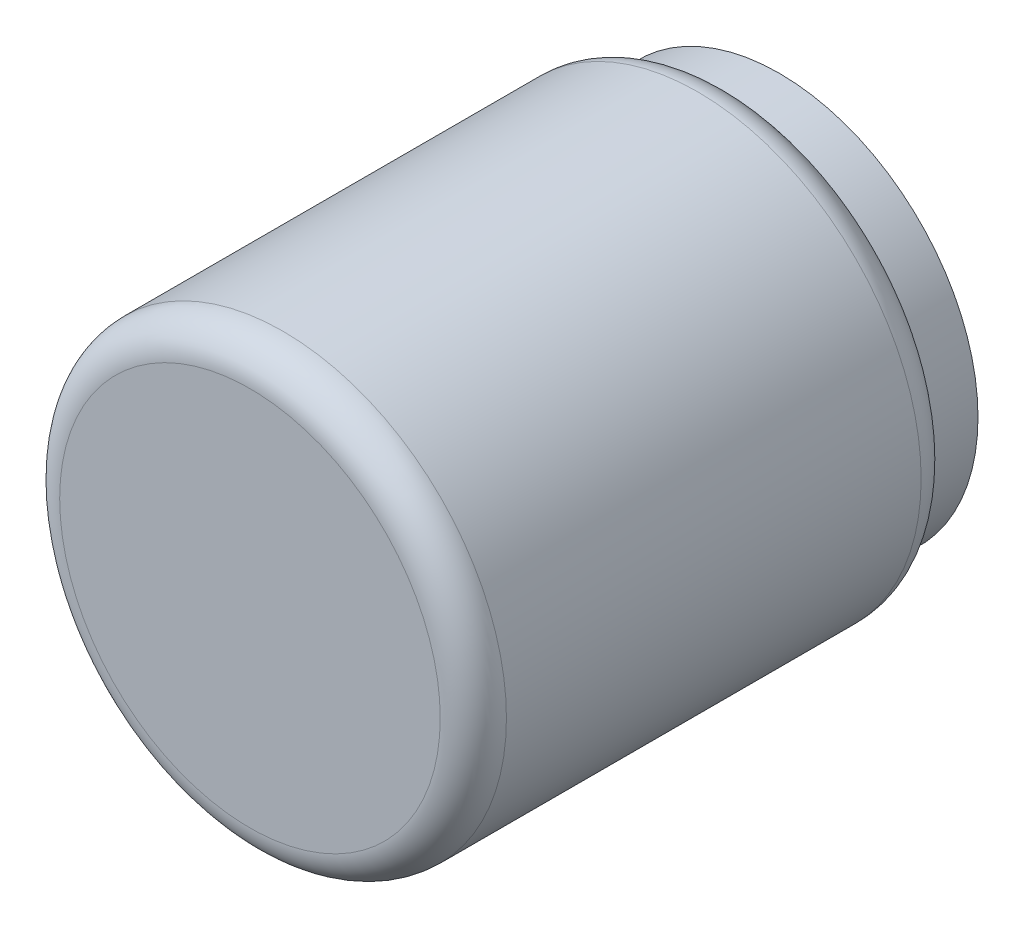
ISO-10303-21;
HEADER;
FILE_DESCRIPTION(('STEP AP214'),'2;1');
FILE_NAME('part.step','',(''),(''),'','','');
FILE_SCHEMA(('AUTOMOTIVE_DESIGN { 1 0 10303 214 1 1 1 1 }'));
ENDSEC;
DATA;
#1=APPLICATION_CONTEXT('core data for automotive mechanical design processes');
#2=APPLICATION_PROTOCOL_DEFINITION('international standard','automotive_design',2000,#1);
#3=PRODUCT_CONTEXT('',#1,'mechanical');
#4=PRODUCT('Part','Part','',(#3));
#5=PRODUCT_RELATED_PRODUCT_CATEGORY('part','',(#4));
#6=PRODUCT_DEFINITION_FORMATION('','',#4);
#7=PRODUCT_DEFINITION_CONTEXT('part definition',#1,'design');
#8=PRODUCT_DEFINITION('design','',#6,#7);
#9=PRODUCT_DEFINITION_SHAPE('','',#8);
#10=(LENGTH_UNIT() NAMED_UNIT(*) SI_UNIT(.MILLI.,.METRE.));
#11=(NAMED_UNIT(*) PLANE_ANGLE_UNIT() SI_UNIT($,.RADIAN.));
#12=(NAMED_UNIT(*) SI_UNIT($,.STERADIAN.) SOLID_ANGLE_UNIT());
#13=UNCERTAINTY_MEASURE_WITH_UNIT(LENGTH_MEASURE(1.E-05),#10,'distance_accuracy_value','');
#14=(GEOMETRIC_REPRESENTATION_CONTEXT(3) GLOBAL_UNCERTAINTY_ASSIGNED_CONTEXT((#13)) GLOBAL_UNIT_ASSIGNED_CONTEXT((#10,
#11,#12)) REPRESENTATION_CONTEXT('',''));
#15=CARTESIAN_POINT('',(0.,0.,0.));
#16=DIRECTION('',(0.,0.,1.));
#17=DIRECTION('',(1.,0.,0.));
#18=AXIS2_PLACEMENT_3D('',#15,#16,#17);
#19=CARTESIAN_POINT('',(0.,0.,32.));
#20=DIRECTION('',(0.,0.,-1.));
#21=DIRECTION('',(-1.,0.,0.));
#22=AXIS2_PLACEMENT_3D('',#19,#20,#21);
#23=CYLINDRICAL_SURFACE('',#22,13.5);
#24=CARTESIAN_POINT('',(0.,0.,4.93649167310371));
#25=DIRECTION('',(0.,0.,-1.));
#26=DIRECTION('',(-1.,0.,0.));
#27=AXIS2_PLACEMENT_3D('',#24,#25,#26);
#28=CIRCLE('',#27,13.5);
#29=CARTESIAN_POINT('',(-13.5,0.,4.93649167310371));
#30=VERTEX_POINT('',#29);
#31=EDGE_CURVE('E10',#30,#30,#28,.F.);
#32=ORIENTED_EDGE('',*,*,#31,.T.);
#33=EDGE_LOOP('',(#32));
#34=FACE_BOUND('',#33,.T.);
#35=CARTESIAN_POINT('',(0.,0.,30.));
#36=DIRECTION('',(0.,0.,1.));
#37=DIRECTION('',(1.,0.,0.));
#38=AXIS2_PLACEMENT_3D('',#35,#36,#37);
#39=CIRCLE('',#38,13.5);
#40=CARTESIAN_POINT('',(13.5,0.,30.));
#41=VERTEX_POINT('',#40);
#42=EDGE_CURVE('E39',#41,#41,#39,.F.);
#43=ORIENTED_EDGE('',*,*,#42,.T.);
#44=EDGE_LOOP('',(#43));
#45=FACE_BOUND('',#44,.T.);
#46=ADVANCED_FACE('F32',(#34,#45),#23,.T.);
#47=CARTESIAN_POINT('',(0.,0.,32.));
#48=DIRECTION('',(0.,0.,1.));
#49=DIRECTION('',(1.,0.,0.));
#50=AXIS2_PLACEMENT_3D('',#47,#48,#49);
#51=PLANE('',#50);
#52=CARTESIAN_POINT('',(0.,0.,32.));
#53=DIRECTION('',(0.,0.,1.));
#54=DIRECTION('',(1.,0.,0.));
#55=AXIS2_PLACEMENT_3D('',#52,#53,#54);
#56=CIRCLE('',#55,11.5);
#57=CARTESIAN_POINT('',(11.5,0.,32.));
#58=VERTEX_POINT('',#57);
#59=EDGE_CURVE('E43',#58,#58,#56,.T.);
#60=ORIENTED_EDGE('',*,*,#59,.T.);
#61=EDGE_LOOP('',(#60));
#62=FACE_BOUND('',#61,.T.);
#63=ADVANCED_FACE('F68',(#62),#51,.T.);
#64=CARTESIAN_POINT('',(0.,0.,30.));
#65=DIRECTION('',(0.,0.,1.));
#66=DIRECTION('',(1.,0.,0.));
#67=AXIS2_PLACEMENT_3D('',#64,#65,#66);
#68=TOROIDAL_SURFACE('',#67,11.5,2.);
#69=ORIENTED_EDGE('',*,*,#42,.F.);
#70=EDGE_LOOP('',(#69));
#71=FACE_BOUND('',#70,.T.);
#72=ORIENTED_EDGE('',*,*,#59,.F.);
#73=EDGE_LOOP('',(#72));
#74=FACE_BOUND('',#73,.T.);
#75=ADVANCED_FACE('F73',(#71,#74),#68,.T.);
#76=CARTESIAN_POINT('',(0.,0.,3.));
#77=DIRECTION('',(0.,0.,-1.));
#78=DIRECTION('',(-1.,0.,0.));
#79=AXIS2_PLACEMENT_3D('',#76,#77,#78);
#80=CYLINDRICAL_SURFACE('',#79,12.);
#81=CARTESIAN_POINT('',(0.,0.,3.));
#82=DIRECTION('',(0.,0.,-1.));
#83=DIRECTION('',(-1.,0.,0.));
#84=AXIS2_PLACEMENT_3D('',#81,#82,#83);
#85=CIRCLE('',#84,12.);
#86=CARTESIAN_POINT('',(-12.,0.,3.));
#87=VERTEX_POINT('',#86);
#88=EDGE_CURVE('E47',#87,#87,#85,.T.);
#89=ORIENTED_EDGE('',*,*,#88,.T.);
#90=EDGE_LOOP('',(#89));
#91=FACE_BOUND('',#90,.T.);
#92=CARTESIAN_POINT('',(0.,0.,0.));
#93=DIRECTION('',(0.,0.,-1.));
#94=DIRECTION('',(-1.,0.,0.));
#95=AXIS2_PLACEMENT_3D('',#92,#93,#94);
#96=CIRCLE('',#95,12.);
#97=CARTESIAN_POINT('',(-12.,0.,0.));
#98=VERTEX_POINT('',#97);
#99=EDGE_CURVE('E50',#98,#98,#96,.T.);
#100=ORIENTED_EDGE('',*,*,#99,.F.);
#101=EDGE_LOOP('',(#100));
#102=FACE_BOUND('',#101,.T.);
#103=ADVANCED_FACE('F56',(#91,#102),#80,.T.);
#104=CARTESIAN_POINT('',(0.,0.,0.));
#105=DIRECTION('',(0.,0.,1.));
#106=DIRECTION('',(1.,0.,0.));
#107=AXIS2_PLACEMENT_3D('',#104,#105,#106);
#108=PLANE('',#107);
#109=ORIENTED_EDGE('',*,*,#99,.T.);
#110=EDGE_LOOP('',(#109));
#111=FACE_BOUND('',#110,.T.);
#112=ADVANCED_FACE('F60',(#111),#108,.F.);
#113=CARTESIAN_POINT('',(0.,0.,4.93649167310371));
#114=DIRECTION('',(0.,0.,-1.));
#115=DIRECTION('',(-1.,0.,0.));
#116=AXIS2_PLACEMENT_3D('',#113,#114,#115);
#117=TOROIDAL_SURFACE('',#116,11.5,2.);
#118=ORIENTED_EDGE('',*,*,#31,.F.);
#119=EDGE_LOOP('',(#118));
#120=FACE_BOUND('',#119,.T.);
#121=ORIENTED_EDGE('',*,*,#88,.F.);
#122=EDGE_LOOP('',(#121));
#123=FACE_BOUND('',#122,.T.);
#124=ADVANCED_FACE('F34',(#120,#123),#117,.T.);
#125=CLOSED_SHELL('',(#46,#63,#75,#103,#112,#124));
#126=MANIFOLD_SOLID_BREP('B2',#125);
#127=ADVANCED_BREP_SHAPE_REPRESENTATION('',(#18,#126),#14);
#128=SHAPE_DEFINITION_REPRESENTATION(#9,#127);
ENDSEC;
END-ISO-10303-21;
